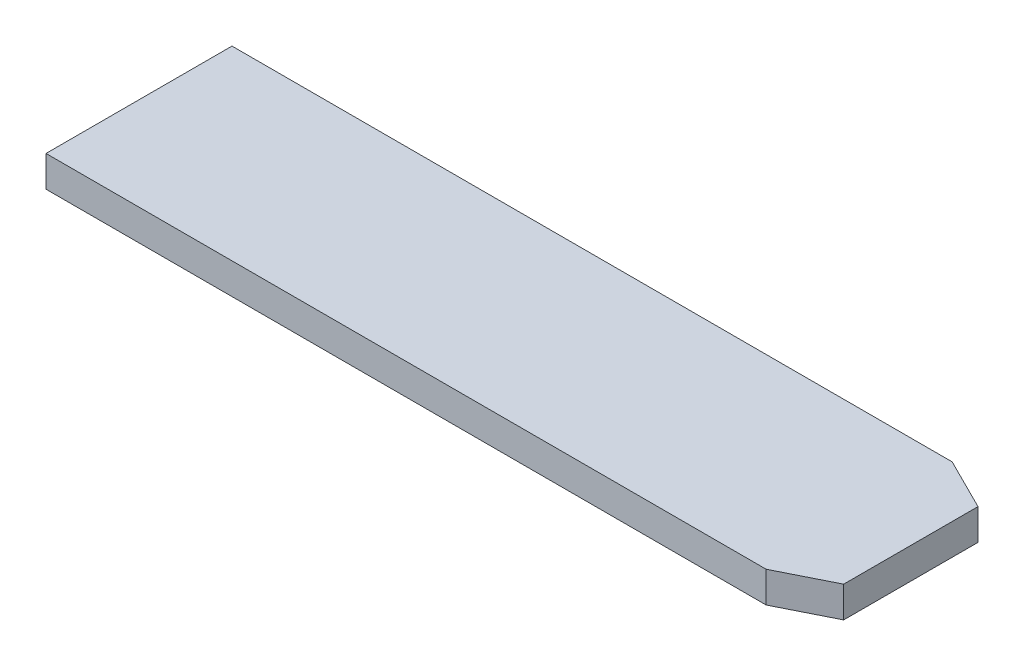
ISO-10303-21;
HEADER;
FILE_DESCRIPTION(('STEP AP214'),'2;1');
FILE_NAME('part.step','',(''),(''),'','','');
FILE_SCHEMA(('AUTOMOTIVE_DESIGN { 1 0 10303 214 1 1 1 1 }'));
ENDSEC;
DATA;
#1=APPLICATION_CONTEXT('core data for automotive mechanical design processes');
#2=APPLICATION_PROTOCOL_DEFINITION('international standard','automotive_design',2000,#1);
#3=PRODUCT_CONTEXT('',#1,'mechanical');
#4=PRODUCT('Part','Part','',(#3));
#5=PRODUCT_RELATED_PRODUCT_CATEGORY('part','',(#4));
#6=PRODUCT_DEFINITION_FORMATION('','',#4);
#7=PRODUCT_DEFINITION_CONTEXT('part definition',#1,'design');
#8=PRODUCT_DEFINITION('design','',#6,#7);
#9=PRODUCT_DEFINITION_SHAPE('','',#8);
#10=(LENGTH_UNIT() NAMED_UNIT(*) SI_UNIT(.MILLI.,.METRE.));
#11=(NAMED_UNIT(*) PLANE_ANGLE_UNIT() SI_UNIT($,.RADIAN.));
#12=(NAMED_UNIT(*) SI_UNIT($,.STERADIAN.) SOLID_ANGLE_UNIT());
#13=UNCERTAINTY_MEASURE_WITH_UNIT(LENGTH_MEASURE(1.E-05),#10,'distance_accuracy_value','');
#14=(GEOMETRIC_REPRESENTATION_CONTEXT(3) GLOBAL_UNCERTAINTY_ASSIGNED_CONTEXT((#13)) GLOBAL_UNIT_ASSIGNED_CONTEXT((#10,
#11,#12)) REPRESENTATION_CONTEXT('',''));
#15=CARTESIAN_POINT('',(0.,0.,0.));
#16=DIRECTION('',(0.,0.,1.));
#17=DIRECTION('',(1.,0.,0.));
#18=AXIS2_PLACEMENT_3D('',#15,#16,#17);
#19=CARTESIAN_POINT('',(-34.85,3.,-9.));
#20=DIRECTION('',(1.,0.,0.));
#21=DIRECTION('',(0.,0.,-1.));
#22=AXIS2_PLACEMENT_3D('',#19,#20,#21);
#23=PLANE('',#22);
#24=DIRECTION('',(0.,0.,1.));
#25=VECTOR('',#24,1.);
#26=CARTESIAN_POINT('',(-34.85,0.,-9.));
#27=LINE('',#26,#25);
#28=CARTESIAN_POINT('',(-34.85,0.,-9.));
#29=VERTEX_POINT('',#28);
#30=CARTESIAN_POINT('',(-34.85,0.,9.));
#31=VERTEX_POINT('',#30);
#32=EDGE_CURVE('E96',#29,#31,#27,.T.);
#33=ORIENTED_EDGE('',*,*,#32,.T.);
#34=DIRECTION('',(0.,-1.,0.));
#35=VECTOR('',#34,1.);
#36=CARTESIAN_POINT('',(-34.85,3.,9.));
#37=LINE('',#36,#35);
#38=CARTESIAN_POINT('',(-34.85,3.,9.));
#39=VERTEX_POINT('',#38);
#40=EDGE_CURVE('E12',#39,#31,#37,.T.);
#41=ORIENTED_EDGE('',*,*,#40,.F.);
#42=DIRECTION('',(0.,0.,1.));
#43=VECTOR('',#42,1.);
#44=CARTESIAN_POINT('',(-34.85,3.,-9.));
#45=LINE('',#44,#43);
#46=CARTESIAN_POINT('',(-34.85,3.,-9.));
#47=VERTEX_POINT('',#46);
#48=EDGE_CURVE('E185',#47,#39,#45,.T.);
#49=ORIENTED_EDGE('',*,*,#48,.F.);
#50=DIRECTION('',(0.,-1.,0.));
#51=VECTOR('',#50,1.);
#52=CARTESIAN_POINT('',(-34.85,3.,-9.));
#53=LINE('',#52,#51);
#54=EDGE_CURVE('E188',#47,#29,#53,.T.);
#55=ORIENTED_EDGE('',*,*,#54,.T.);
#56=EDGE_LOOP('',(#33,#41,#49,#55));
#57=FACE_BOUND('',#56,.T.);
#58=ADVANCED_FACE('F47',(#57),#23,.F.);
#59=CARTESIAN_POINT('',(34.85,3.,8.99999999999999));
#60=DIRECTION('',(0.,0.,-1.));
#61=DIRECTION('',(-1.,0.,0.));
#62=AXIS2_PLACEMENT_3D('',#59,#60,#61);
#63=PLANE('',#62);
#64=DIRECTION('',(1.,0.,0.));
#65=VECTOR('',#64,1.);
#66=CARTESIAN_POINT('',(34.85,0.,8.99999999999999));
#67=LINE('',#66,#65);
#68=CARTESIAN_POINT('',(34.85,0.,8.99999999999999));
#69=VERTEX_POINT('',#68);
#70=EDGE_CURVE('E85',#31,#69,#67,.T.);
#71=ORIENTED_EDGE('',*,*,#70,.T.);
#72=DIRECTION('',(0.,1.,0.));
#73=VECTOR('',#72,1.);
#74=CARTESIAN_POINT('',(34.85,0.,8.99999999999999));
#75=LINE('',#74,#73);
#76=CARTESIAN_POINT('',(34.85,3.,8.99999999999999));
#77=VERTEX_POINT('',#76);
#78=EDGE_CURVE('E56',#77,#69,#75,.F.);
#79=ORIENTED_EDGE('',*,*,#78,.F.);
#80=DIRECTION('',(1.,0.,0.));
#81=VECTOR('',#80,1.);
#82=CARTESIAN_POINT('',(34.85,3.,8.99999999999999));
#83=LINE('',#82,#81);
#84=EDGE_CURVE('E192',#39,#77,#83,.T.);
#85=ORIENTED_EDGE('',*,*,#84,.F.);
#86=ORIENTED_EDGE('',*,*,#40,.T.);
#87=EDGE_LOOP('',(#71,#79,#85,#86));
#88=FACE_BOUND('',#87,.T.);
#89=ADVANCED_FACE('F87',(#88),#63,.F.);
#90=CARTESIAN_POINT('',(34.85,3.,-9.00000000000001));
#91=DIRECTION('',(0.,0.,1.));
#92=DIRECTION('',(1.,0.,0.));
#93=AXIS2_PLACEMENT_3D('',#90,#91,#92);
#94=PLANE('',#93);
#95=DIRECTION('',(-1.,0.,0.));
#96=VECTOR('',#95,1.);
#97=CARTESIAN_POINT('',(34.85,0.,-9.00000000000001));
#98=LINE('',#97,#96);
#99=CARTESIAN_POINT('',(34.85,0.,-9.00000000000001));
#100=VERTEX_POINT('',#99);
#101=EDGE_CURVE('E95',#100,#29,#98,.T.);
#102=ORIENTED_EDGE('',*,*,#101,.T.);
#103=ORIENTED_EDGE('',*,*,#54,.F.);
#104=DIRECTION('',(-1.,0.,0.));
#105=VECTOR('',#104,1.);
#106=CARTESIAN_POINT('',(34.85,3.,-9.00000000000001));
#107=LINE('',#106,#105);
#108=CARTESIAN_POINT('',(34.85,3.,-9.00000000000001));
#109=VERTEX_POINT('',#108);
#110=EDGE_CURVE('E65',#109,#47,#107,.T.);
#111=ORIENTED_EDGE('',*,*,#110,.F.);
#112=DIRECTION('',(0.,1.,0.));
#113=VECTOR('',#112,1.);
#114=CARTESIAN_POINT('',(34.85,3.,-9.00000000000001));
#115=LINE('',#114,#113);
#116=EDGE_CURVE('E50',#109,#100,#115,.F.);
#117=ORIENTED_EDGE('',*,*,#116,.T.);
#118=EDGE_LOOP('',(#102,#103,#111,#117));
#119=FACE_BOUND('',#118,.T.);
#120=ADVANCED_FACE('F187',(#119),#94,.F.);
#121=CARTESIAN_POINT('',(0.,3.,0.));
#122=DIRECTION('',(0.,-1.,0.));
#123=DIRECTION('',(0.,0.,-1.));
#124=AXIS2_PLACEMENT_3D('',#121,#122,#123);
#125=PLANE('',#124);
#126=ORIENTED_EDGE('',*,*,#48,.T.);
#127=ORIENTED_EDGE('',*,*,#84,.T.);
#128=DIRECTION('',(-0.894427190999916,0.,0.447213595499957));
#129=VECTOR('',#128,1.);
#130=CARTESIAN_POINT('',(39.85,3.,6.5));
#131=LINE('',#130,#129);
#132=CARTESIAN_POINT('',(39.85,3.,6.5));
#133=VERTEX_POINT('',#132);
#134=EDGE_CURVE('E105',#133,#77,#131,.T.);
#135=ORIENTED_EDGE('',*,*,#134,.F.);
#136=DIRECTION('',(0.,0.,1.));
#137=VECTOR('',#136,1.);
#138=CARTESIAN_POINT('',(39.85,3.,6.5));
#139=LINE('',#138,#137);
#140=CARTESIAN_POINT('',(39.85,3.,-6.5));
#141=VERTEX_POINT('',#140);
#142=EDGE_CURVE('E173',#141,#133,#139,.T.);
#143=ORIENTED_EDGE('',*,*,#142,.F.);
#144=DIRECTION('',(-0.894427190999915,0.,-0.447213595499959));
#145=VECTOR('',#144,1.);
#146=CARTESIAN_POINT('',(39.85,3.,-6.5));
#147=LINE('',#146,#145);
#148=EDGE_CURVE('E115',#141,#109,#147,.T.);
#149=ORIENTED_EDGE('',*,*,#148,.T.);
#150=ORIENTED_EDGE('',*,*,#110,.T.);
#151=EDGE_LOOP('',(#126,#127,#135,#143,#149,#150));
#152=FACE_BOUND('',#151,.T.);
#153=ADVANCED_FACE('F148',(#152),#125,.F.);
#154=CARTESIAN_POINT('',(0.,0.,0.));
#155=DIRECTION('',(0.,-1.,0.));
#156=DIRECTION('',(0.,0.,-1.));
#157=AXIS2_PLACEMENT_3D('',#154,#155,#156);
#158=PLANE('',#157);
#159=ORIENTED_EDGE('',*,*,#32,.F.);
#160=ORIENTED_EDGE('',*,*,#101,.F.);
#161=DIRECTION('',(-0.894427190999915,0.,-0.447213595499959));
#162=VECTOR('',#161,1.);
#163=CARTESIAN_POINT('',(39.85,0.,-6.5));
#164=LINE('',#163,#162);
#165=CARTESIAN_POINT('',(39.85,0.,-6.5));
#166=VERTEX_POINT('',#165);
#167=EDGE_CURVE('E112',#166,#100,#164,.T.);
#168=ORIENTED_EDGE('',*,*,#167,.F.);
#169=DIRECTION('',(0.,0.,-1.));
#170=VECTOR('',#169,1.);
#171=CARTESIAN_POINT('',(39.85,0.,6.5));
#172=LINE('',#171,#170);
#173=CARTESIAN_POINT('',(39.85,0.,6.5));
#174=VERTEX_POINT('',#173);
#175=EDGE_CURVE('E110',#174,#166,#172,.T.);
#176=ORIENTED_EDGE('',*,*,#175,.F.);
#177=DIRECTION('',(-0.894427190999916,0.,0.447213595499957));
#178=VECTOR('',#177,1.);
#179=CARTESIAN_POINT('',(39.85,0.,6.5));
#180=LINE('',#179,#178);
#181=EDGE_CURVE('E103',#174,#69,#180,.T.);
#182=ORIENTED_EDGE('',*,*,#181,.T.);
#183=ORIENTED_EDGE('',*,*,#70,.F.);
#184=EDGE_LOOP('',(#159,#160,#168,#176,#182,#183));
#185=FACE_BOUND('',#184,.T.);
#186=ADVANCED_FACE('F107',(#185),#158,.T.);
#187=CARTESIAN_POINT('',(39.85,0.,0.));
#188=DIRECTION('',(1.,0.,0.));
#189=DIRECTION('',(0.,0.,-1.));
#190=AXIS2_PLACEMENT_3D('',#187,#188,#189);
#191=PLANE('',#190);
#192=DIRECTION('',(0.,1.,0.));
#193=VECTOR('',#192,1.);
#194=CARTESIAN_POINT('',(39.85,3.,-6.5));
#195=LINE('',#194,#193);
#196=EDGE_CURVE('E165',#166,#141,#195,.T.);
#197=ORIENTED_EDGE('',*,*,#196,.T.);
#198=ORIENTED_EDGE('',*,*,#142,.T.);
#199=DIRECTION('',(0.,-1.,0.));
#200=VECTOR('',#199,1.);
#201=CARTESIAN_POINT('',(39.85,3.,6.5));
#202=LINE('',#201,#200);
#203=EDGE_CURVE('E125',#133,#174,#202,.T.);
#204=ORIENTED_EDGE('',*,*,#203,.T.);
#205=ORIENTED_EDGE('',*,*,#175,.T.);
#206=EDGE_LOOP('',(#197,#198,#204,#205));
#207=FACE_BOUND('',#206,.T.);
#208=ADVANCED_FACE('F142',(#207),#191,.T.);
#209=CARTESIAN_POINT('',(10.57,0.,21.14));
#210=DIRECTION('',(0.447213595499957,0.,0.894427190999916));
#211=DIRECTION('',(0.894427190999916,0.,-0.447213595499957));
#212=AXIS2_PLACEMENT_3D('',#209,#210,#211);
#213=PLANE('',#212);
#214=ORIENTED_EDGE('',*,*,#134,.T.);
#215=ORIENTED_EDGE('',*,*,#78,.T.);
#216=ORIENTED_EDGE('',*,*,#181,.F.);
#217=ORIENTED_EDGE('',*,*,#203,.F.);
#218=EDGE_LOOP('',(#214,#215,#216,#217));
#219=FACE_BOUND('',#218,.T.);
#220=ADVANCED_FACE('F100',(#219),#213,.T.);
#221=CARTESIAN_POINT('',(10.5700000000001,0.,-21.14));
#222=DIRECTION('',(-0.447213595499959,0.,0.894427190999916));
#223=DIRECTION('',(0.894427190999915,0.,0.447213595499959));
#224=AXIS2_PLACEMENT_3D('',#221,#222,#223);
#225=PLANE('',#224);
#226=ORIENTED_EDGE('',*,*,#167,.T.);
#227=ORIENTED_EDGE('',*,*,#116,.F.);
#228=ORIENTED_EDGE('',*,*,#148,.F.);
#229=ORIENTED_EDGE('',*,*,#196,.F.);
#230=EDGE_LOOP('',(#226,#227,#228,#229));
#231=FACE_BOUND('',#230,.T.);
#232=ADVANCED_FACE('F141',(#231),#225,.F.);
#233=CLOSED_SHELL('',(#58,#89,#120,#153,#186,#208,#220,#232));
#234=MANIFOLD_SOLID_BREP('B2',#233);
#235=ADVANCED_BREP_SHAPE_REPRESENTATION('',(#18,#234),#14);
#236=SHAPE_DEFINITION_REPRESENTATION(#9,#235);
ENDSEC;
END-ISO-10303-21;
